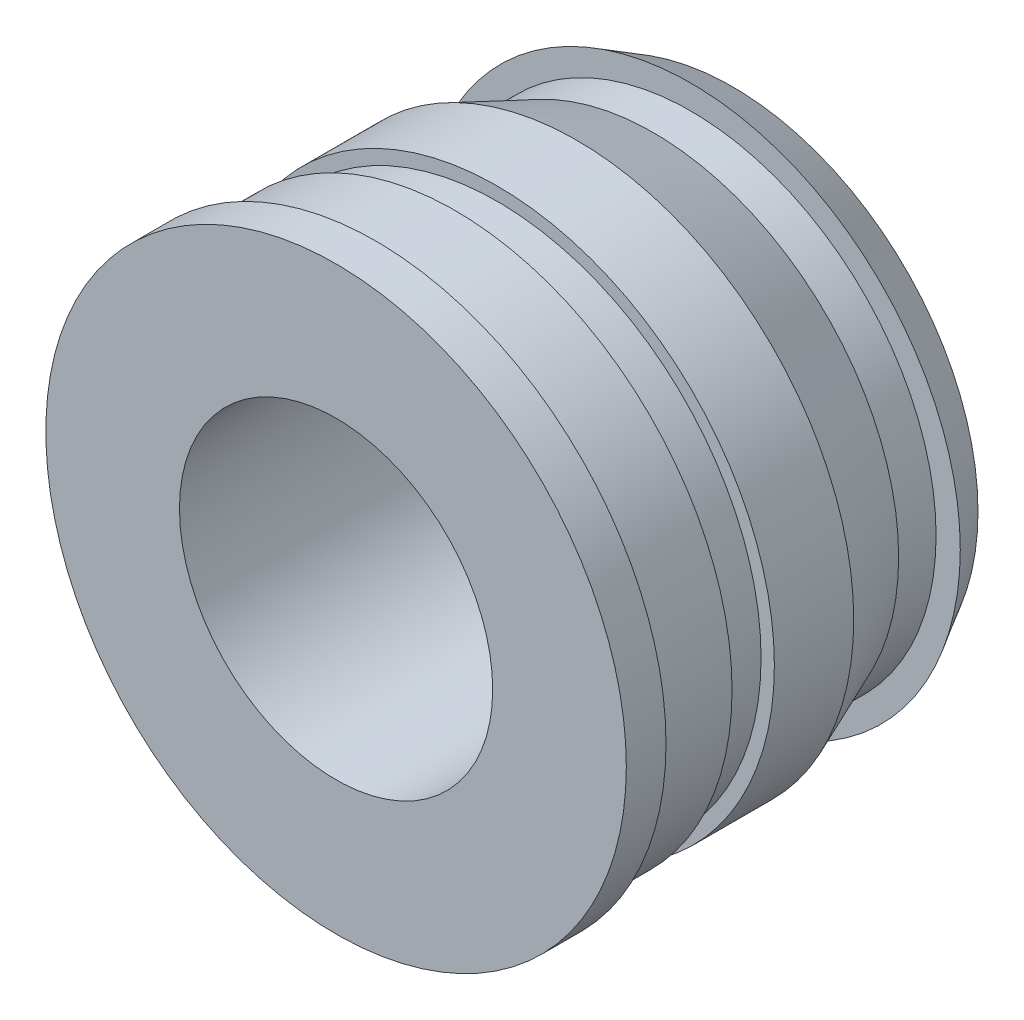
ISO-10303-21;
HEADER;
FILE_DESCRIPTION(('STEP AP214'),'2;1');
FILE_NAME('part.step','',(''),(''),'','','');
FILE_SCHEMA(('AUTOMOTIVE_DESIGN { 1 0 10303 214 1 1 1 1 }'));
ENDSEC;
DATA;
#1=APPLICATION_CONTEXT('core data for automotive mechanical design processes');
#2=APPLICATION_PROTOCOL_DEFINITION('international standard','automotive_design',2000,#1);
#3=PRODUCT_CONTEXT('',#1,'mechanical');
#4=PRODUCT('Part','Part','',(#3));
#5=PRODUCT_RELATED_PRODUCT_CATEGORY('part','',(#4));
#6=PRODUCT_DEFINITION_FORMATION('','',#4);
#7=PRODUCT_DEFINITION_CONTEXT('part definition',#1,'design');
#8=PRODUCT_DEFINITION('design','',#6,#7);
#9=PRODUCT_DEFINITION_SHAPE('','',#8);
#10=(LENGTH_UNIT() NAMED_UNIT(*) SI_UNIT(.MILLI.,.METRE.));
#11=(NAMED_UNIT(*) PLANE_ANGLE_UNIT() SI_UNIT($,.RADIAN.));
#12=(NAMED_UNIT(*) SI_UNIT($,.STERADIAN.) SOLID_ANGLE_UNIT());
#13=UNCERTAINTY_MEASURE_WITH_UNIT(LENGTH_MEASURE(1.E-05),#10,'distance_accuracy_value','');
#14=(GEOMETRIC_REPRESENTATION_CONTEXT(3) GLOBAL_UNCERTAINTY_ASSIGNED_CONTEXT((#13)) GLOBAL_UNIT_ASSIGNED_CONTEXT((#10,
#11,#12)) REPRESENTATION_CONTEXT('',''));
#15=CARTESIAN_POINT('',(0.,0.,0.));
#16=DIRECTION('',(0.,0.,1.));
#17=DIRECTION('',(1.,0.,0.));
#18=AXIS2_PLACEMENT_3D('',#15,#16,#17);
#19=CARTESIAN_POINT('',(0.,0.,1.9));
#20=DIRECTION('',(0.,0.,1.));
#21=DIRECTION('',(1.,0.,0.));
#22=AXIS2_PLACEMENT_3D('',#19,#20,#21);
#23=CYLINDRICAL_SURFACE('',#22,1.5);
#24=CARTESIAN_POINT('',(0.,0.,-1.9));
#25=DIRECTION('',(0.,0.,1.));
#26=DIRECTION('',(1.,0.,0.));
#27=AXIS2_PLACEMENT_3D('',#24,#25,#26);
#28=CIRCLE('',#27,1.5);
#29=CARTESIAN_POINT('',(1.5,0.,-1.9));
#30=VERTEX_POINT('',#29);
#31=EDGE_CURVE('E96',#30,#30,#28,.T.);
#32=ORIENTED_EDGE('',*,*,#31,.F.);
#33=EDGE_LOOP('',(#32));
#34=FACE_BOUND('',#33,.T.);
#35=CARTESIAN_POINT('',(0.,0.,1.9));
#36=DIRECTION('',(0.,0.,1.));
#37=DIRECTION('',(1.,0.,0.));
#38=AXIS2_PLACEMENT_3D('',#35,#36,#37);
#39=CIRCLE('',#38,1.5);
#40=CARTESIAN_POINT('',(1.5,0.,1.9));
#41=VERTEX_POINT('',#40);
#42=EDGE_CURVE('E10',#41,#41,#39,.T.);
#43=ORIENTED_EDGE('',*,*,#42,.T.);
#44=EDGE_LOOP('',(#43));
#45=FACE_BOUND('',#44,.T.);
#46=ADVANCED_FACE('F37',(#34,#45),#23,.F.);
#47=CARTESIAN_POINT('',(0.,1.5,1.9));
#48=DIRECTION('',(0.,0.,-1.));
#49=DIRECTION('',(-1.,0.,0.));
#50=AXIS2_PLACEMENT_3D('',#47,#48,#49);
#51=PLANE('',#50);
#52=ORIENTED_EDGE('',*,*,#42,.F.);
#53=EDGE_LOOP('',(#52));
#54=FACE_BOUND('',#53,.T.);
#55=CARTESIAN_POINT('',(0.,0.,1.9));
#56=DIRECTION('',(0.,0.,1.));
#57=DIRECTION('',(1.,0.,0.));
#58=AXIS2_PLACEMENT_3D('',#55,#56,#57);
#59=CIRCLE('',#58,2.78);
#60=CARTESIAN_POINT('',(2.78,0.,1.9));
#61=VERTEX_POINT('',#60);
#62=EDGE_CURVE('E44',#61,#61,#59,.T.);
#63=ORIENTED_EDGE('',*,*,#62,.T.);
#64=EDGE_LOOP('',(#63));
#65=FACE_BOUND('',#64,.T.);
#66=ADVANCED_FACE('F104',(#54,#65),#51,.F.);
#67=CARTESIAN_POINT('',(0.,0.,1.9));
#68=DIRECTION('',(0.,0.,1.));
#69=DIRECTION('',(1.,0.,0.));
#70=AXIS2_PLACEMENT_3D('',#67,#68,#69);
#71=CYLINDRICAL_SURFACE('',#70,2.78);
#72=ORIENTED_EDGE('',*,*,#62,.F.);
#73=EDGE_LOOP('',(#72));
#74=FACE_BOUND('',#73,.T.);
#75=CARTESIAN_POINT('',(0.,0.,1.52));
#76=DIRECTION('',(0.,0.,1.));
#77=DIRECTION('',(1.,0.,0.));
#78=AXIS2_PLACEMENT_3D('',#75,#76,#77);
#79=CIRCLE('',#78,2.78);
#80=CARTESIAN_POINT('',(2.78,0.,1.52));
#81=VERTEX_POINT('',#80);
#82=EDGE_CURVE('E49',#81,#81,#79,.T.);
#83=ORIENTED_EDGE('',*,*,#82,.T.);
#84=EDGE_LOOP('',(#83));
#85=FACE_BOUND('',#84,.T.);
#86=ADVANCED_FACE('F108',(#74,#85),#71,.T.);
#87=CARTESIAN_POINT('',(0.,2.78,1.52));
#88=DIRECTION('',(0.,0.,1.));
#89=DIRECTION('',(1.,0.,0.));
#90=AXIS2_PLACEMENT_3D('',#87,#88,#89);
#91=PLANE('',#90);
#92=ORIENTED_EDGE('',*,*,#82,.F.);
#93=EDGE_LOOP('',(#92));
#94=FACE_BOUND('',#93,.T.);
#95=CARTESIAN_POINT('',(0.,0.,1.52));
#96=DIRECTION('',(0.,0.,1.));
#97=DIRECTION('',(1.,0.,0.));
#98=AXIS2_PLACEMENT_3D('',#95,#96,#97);
#99=CIRCLE('',#98,2.6525);
#100=CARTESIAN_POINT('',(2.6525,0.,1.52));
#101=VERTEX_POINT('',#100);
#102=EDGE_CURVE('E54',#101,#101,#99,.T.);
#103=ORIENTED_EDGE('',*,*,#102,.T.);
#104=EDGE_LOOP('',(#103));
#105=FACE_BOUND('',#104,.T.);
#106=ADVANCED_FACE('F113',(#94,#105),#91,.F.);
#107=CARTESIAN_POINT('',(0.,0.,1.9));
#108=DIRECTION('',(0.,0.,1.));
#109=DIRECTION('',(1.,0.,0.));
#110=AXIS2_PLACEMENT_3D('',#107,#108,#109);
#111=CYLINDRICAL_SURFACE('',#110,2.6525);
#112=ORIENTED_EDGE('',*,*,#102,.F.);
#113=EDGE_LOOP('',(#112));
#114=FACE_BOUND('',#113,.T.);
#115=CARTESIAN_POINT('',(0.,0.,0.76));
#116=DIRECTION('',(0.,0.,1.));
#117=DIRECTION('',(1.,0.,0.));
#118=AXIS2_PLACEMENT_3D('',#115,#116,#117);
#119=CIRCLE('',#118,2.6525);
#120=CARTESIAN_POINT('',(2.6525,0.,0.76));
#121=VERTEX_POINT('',#120);
#122=EDGE_CURVE('E60',#121,#121,#119,.T.);
#123=ORIENTED_EDGE('',*,*,#122,.T.);
#124=EDGE_LOOP('',(#123));
#125=FACE_BOUND('',#124,.T.);
#126=ADVANCED_FACE('F119',(#114,#125),#111,.T.);
#127=CARTESIAN_POINT('',(0.,2.6525,0.76));
#128=DIRECTION('',(0.,0.,1.));
#129=DIRECTION('',(1.,0.,0.));
#130=AXIS2_PLACEMENT_3D('',#127,#128,#129);
#131=PLANE('',#130);
#132=ORIENTED_EDGE('',*,*,#122,.F.);
#133=EDGE_LOOP('',(#132));
#134=FACE_BOUND('',#133,.T.);
#135=CARTESIAN_POINT('',(0.,0.,0.76));
#136=DIRECTION('',(0.,0.,1.));
#137=DIRECTION('',(1.,0.,0.));
#138=AXIS2_PLACEMENT_3D('',#135,#136,#137);
#139=CIRCLE('',#138,2.525);
#140=CARTESIAN_POINT('',(2.525,0.,0.76));
#141=VERTEX_POINT('',#140);
#142=EDGE_CURVE('E64',#141,#141,#139,.T.);
#143=ORIENTED_EDGE('',*,*,#142,.T.);
#144=EDGE_LOOP('',(#143));
#145=FACE_BOUND('',#144,.T.);
#146=ADVANCED_FACE('F123',(#134,#145),#131,.F.);
#147=CARTESIAN_POINT('',(0.,0.,1.9));
#148=DIRECTION('',(0.,0.,1.));
#149=DIRECTION('',(1.,0.,0.));
#150=AXIS2_PLACEMENT_3D('',#147,#148,#149);
#151=CYLINDRICAL_SURFACE('',#150,2.525);
#152=ORIENTED_EDGE('',*,*,#142,.F.);
#153=EDGE_LOOP('',(#152));
#154=FACE_BOUND('',#153,.T.);
#155=CARTESIAN_POINT('',(0.,0.,0.354524476352013));
#156=DIRECTION('',(0.,0.,1.));
#157=DIRECTION('',(1.,0.,0.));
#158=AXIS2_PLACEMENT_3D('',#155,#156,#157);
#159=CIRCLE('',#158,2.525);
#160=CARTESIAN_POINT('',(2.525,0.,0.354524476352013));
#161=VERTEX_POINT('',#160);
#162=EDGE_CURVE('E68',#161,#161,#159,.T.);
#163=ORIENTED_EDGE('',*,*,#162,.T.);
#164=EDGE_LOOP('',(#163));
#165=FACE_BOUND('',#164,.T.);
#166=ADVANCED_FACE('F127',(#154,#165),#151,.T.);
#167=CARTESIAN_POINT('',(0.,2.525,0.354524476352013));
#168=DIRECTION('',(0.,0.,-1.));
#169=DIRECTION('',(-1.,0.,0.));
#170=AXIS2_PLACEMENT_3D('',#167,#168,#169);
#171=PLANE('',#170);
#172=ORIENTED_EDGE('',*,*,#162,.F.);
#173=EDGE_LOOP('',(#172));
#174=FACE_BOUND('',#173,.T.);
#175=CARTESIAN_POINT('',(0.,0.,0.354524476352013));
#176=DIRECTION('',(0.,0.,1.));
#177=DIRECTION('',(1.,0.,0.));
#178=AXIS2_PLACEMENT_3D('',#175,#176,#177);
#179=CIRCLE('',#178,2.6525);
#180=CARTESIAN_POINT('',(2.6525,0.,0.354524476352013));
#181=VERTEX_POINT('',#180);
#182=EDGE_CURVE('E72',#181,#181,#179,.T.);
#183=ORIENTED_EDGE('',*,*,#182,.T.);
#184=EDGE_LOOP('',(#183));
#185=FACE_BOUND('',#184,.T.);
#186=ADVANCED_FACE('F131',(#174,#185),#171,.F.);
#187=CARTESIAN_POINT('',(0.,0.,1.9));
#188=DIRECTION('',(0.,0.,1.));
#189=DIRECTION('',(1.,0.,0.));
#190=AXIS2_PLACEMENT_3D('',#187,#188,#189);
#191=CYLINDRICAL_SURFACE('',#190,2.6525);
#192=ORIENTED_EDGE('',*,*,#182,.F.);
#193=EDGE_LOOP('',(#192));
#194=FACE_BOUND('',#193,.T.);
#195=CARTESIAN_POINT('',(0.,0.,-0.405475523647987));
#196=DIRECTION('',(0.,0.,1.));
#197=DIRECTION('',(1.,0.,0.));
#198=AXIS2_PLACEMENT_3D('',#195,#196,#197);
#199=CIRCLE('',#198,2.6525);
#200=CARTESIAN_POINT('',(2.6525,0.,-0.405475523647987));
#201=VERTEX_POINT('',#200);
#202=EDGE_CURVE('E76',#201,#201,#199,.T.);
#203=ORIENTED_EDGE('',*,*,#202,.T.);
#204=EDGE_LOOP('',(#203));
#205=FACE_BOUND('',#204,.T.);
#206=ADVANCED_FACE('F135',(#194,#205),#191,.T.);
#207=CARTESIAN_POINT('',(0.,0.,-1.14));
#208=DIRECTION('',(0.,0.,1.));
#209=DIRECTION('',(1.,0.,0.));
#210=AXIS2_PLACEMENT_3D('',#207,#208,#209);
#211=CONICAL_SURFACE('',#210,2.34825,0.392699081698725);
#212=ORIENTED_EDGE('',*,*,#202,.F.);
#213=EDGE_LOOP('',(#212));
#214=FACE_BOUND('',#213,.T.);
#215=CARTESIAN_POINT('',(0.,0.,-1.14));
#216=DIRECTION('',(0.,0.,1.));
#217=DIRECTION('',(1.,0.,0.));
#218=AXIS2_PLACEMENT_3D('',#215,#216,#217);
#219=CIRCLE('',#218,2.34825);
#220=CARTESIAN_POINT('',(2.34825,0.,-1.14));
#221=VERTEX_POINT('',#220);
#222=EDGE_CURVE('E80',#221,#221,#219,.T.);
#223=ORIENTED_EDGE('',*,*,#222,.T.);
#224=EDGE_LOOP('',(#223));
#225=FACE_BOUND('',#224,.T.);
#226=ADVANCED_FACE('F139',(#214,#225),#211,.T.);
#227=CARTESIAN_POINT('',(0.,0.,1.9));
#228=DIRECTION('',(0.,0.,1.));
#229=DIRECTION('',(1.,0.,0.));
#230=AXIS2_PLACEMENT_3D('',#227,#228,#229);
#231=CYLINDRICAL_SURFACE('',#230,2.34825);
#232=ORIENTED_EDGE('',*,*,#222,.F.);
#233=EDGE_LOOP('',(#232));
#234=FACE_BOUND('',#233,.T.);
#235=CARTESIAN_POINT('',(0.,0.,-1.49859722534591));
#236=DIRECTION('',(0.,0.,1.));
#237=DIRECTION('',(1.,0.,0.));
#238=AXIS2_PLACEMENT_3D('',#235,#236,#237);
#239=CIRCLE('',#238,2.34825);
#240=CARTESIAN_POINT('',(2.34825,0.,-1.49859722534591));
#241=VERTEX_POINT('',#240);
#242=EDGE_CURVE('E84',#241,#241,#239,.T.);
#243=ORIENTED_EDGE('',*,*,#242,.T.);
#244=EDGE_LOOP('',(#243));
#245=FACE_BOUND('',#244,.T.);
#246=ADVANCED_FACE('F143',(#234,#245),#231,.T.);
#247=CARTESIAN_POINT('',(0.,2.34825,-1.49859722534591));
#248=DIRECTION('',(0.,0.,-1.));
#249=DIRECTION('',(-1.,0.,0.));
#250=AXIS2_PLACEMENT_3D('',#247,#248,#249);
#251=PLANE('',#250);
#252=ORIENTED_EDGE('',*,*,#242,.F.);
#253=EDGE_LOOP('',(#252));
#254=FACE_BOUND('',#253,.T.);
#255=CARTESIAN_POINT('',(0.,0.,-1.49859722534591));
#256=DIRECTION('',(0.,0.,1.));
#257=DIRECTION('',(1.,0.,0.));
#258=AXIS2_PLACEMENT_3D('',#255,#256,#257);
#259=CIRCLE('',#258,2.58);
#260=CARTESIAN_POINT('',(2.58,0.,-1.49859722534591));
#261=VERTEX_POINT('',#260);
#262=EDGE_CURVE('E88',#261,#261,#259,.T.);
#263=ORIENTED_EDGE('',*,*,#262,.T.);
#264=EDGE_LOOP('',(#263));
#265=FACE_BOUND('',#264,.T.);
#266=ADVANCED_FACE('F147',(#254,#265),#251,.F.);
#267=CARTESIAN_POINT('',(0.,0.,-1.9));
#268=DIRECTION('',(0.,0.,1.));
#269=DIRECTION('',(1.,0.,0.));
#270=AXIS2_PLACEMENT_3D('',#267,#268,#269);
#271=CONICAL_SURFACE('',#270,2.34825,0.523598775598301);
#272=ORIENTED_EDGE('',*,*,#262,.F.);
#273=EDGE_LOOP('',(#272));
#274=FACE_BOUND('',#273,.T.);
#275=CARTESIAN_POINT('',(0.,0.,-1.9));
#276=DIRECTION('',(0.,0.,1.));
#277=DIRECTION('',(1.,0.,0.));
#278=AXIS2_PLACEMENT_3D('',#275,#276,#277);
#279=CIRCLE('',#278,2.34825);
#280=CARTESIAN_POINT('',(2.34825,0.,-1.9));
#281=VERTEX_POINT('',#280);
#282=EDGE_CURVE('E92',#281,#281,#279,.T.);
#283=ORIENTED_EDGE('',*,*,#282,.T.);
#284=EDGE_LOOP('',(#283));
#285=FACE_BOUND('',#284,.T.);
#286=ADVANCED_FACE('F151',(#274,#285),#271,.T.);
#287=CARTESIAN_POINT('',(0.,2.34825,-1.9));
#288=DIRECTION('',(0.,0.,1.));
#289=DIRECTION('',(1.,0.,0.));
#290=AXIS2_PLACEMENT_3D('',#287,#288,#289);
#291=PLANE('',#290);
#292=ORIENTED_EDGE('',*,*,#282,.F.);
#293=EDGE_LOOP('',(#292));
#294=FACE_BOUND('',#293,.T.);
#295=ORIENTED_EDGE('',*,*,#31,.T.);
#296=EDGE_LOOP('',(#295));
#297=FACE_BOUND('',#296,.T.);
#298=ADVANCED_FACE('F101',(#294,#297),#291,.F.);
#299=CLOSED_SHELL('',(#46,#66,#86,#106,#126,#146,#166,#186,#206,#226,#246,#266,#286,#298));
#300=MANIFOLD_SOLID_BREP('B2',#299);
#301=ADVANCED_BREP_SHAPE_REPRESENTATION('',(#18,#300),#14);
#302=SHAPE_DEFINITION_REPRESENTATION(#9,#301);
ENDSEC;
END-ISO-10303-21;
